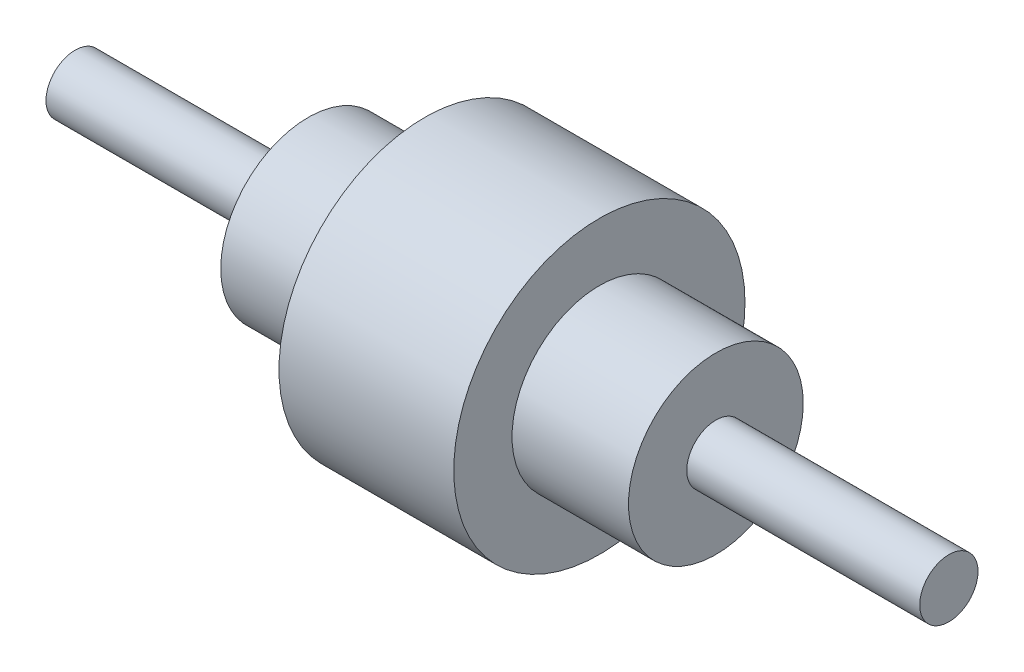
ISO-10303-21;
HEADER;
FILE_DESCRIPTION(('STEP AP214'),'2;1');
FILE_NAME('part.step','',(''),(''),'','','');
FILE_SCHEMA(('AUTOMOTIVE_DESIGN { 1 0 10303 214 1 1 1 1 }'));
ENDSEC;
DATA;
#1=APPLICATION_CONTEXT('core data for automotive mechanical design processes');
#2=APPLICATION_PROTOCOL_DEFINITION('international standard','automotive_design',2000,#1);
#3=PRODUCT_CONTEXT('',#1,'mechanical');
#4=PRODUCT('Part','Part','',(#3));
#5=PRODUCT_RELATED_PRODUCT_CATEGORY('part','',(#4));
#6=PRODUCT_DEFINITION_FORMATION('','',#4);
#7=PRODUCT_DEFINITION_CONTEXT('part definition',#1,'design');
#8=PRODUCT_DEFINITION('design','',#6,#7);
#9=PRODUCT_DEFINITION_SHAPE('','',#8);
#10=(LENGTH_UNIT() NAMED_UNIT(*) SI_UNIT(.MILLI.,.METRE.));
#11=(NAMED_UNIT(*) PLANE_ANGLE_UNIT() SI_UNIT($,.RADIAN.));
#12=(NAMED_UNIT(*) SI_UNIT($,.STERADIAN.) SOLID_ANGLE_UNIT());
#13=UNCERTAINTY_MEASURE_WITH_UNIT(LENGTH_MEASURE(1.E-05),#10,'distance_accuracy_value','');
#14=(GEOMETRIC_REPRESENTATION_CONTEXT(3) GLOBAL_UNCERTAINTY_ASSIGNED_CONTEXT((#13)) GLOBAL_UNIT_ASSIGNED_CONTEXT((#10,
#11,#12)) REPRESENTATION_CONTEXT('',''));
#15=CARTESIAN_POINT('',(0.,0.,0.));
#16=DIRECTION('',(0.,0.,1.));
#17=DIRECTION('',(1.,0.,0.));
#18=AXIS2_PLACEMENT_3D('',#15,#16,#17);
#19=CARTESIAN_POINT('',(30.,0.,0.));
#20=DIRECTION('',(-1.,0.,0.));
#21=DIRECTION('',(0.,0.,1.));
#22=AXIS2_PLACEMENT_3D('',#19,#20,#21);
#23=CYLINDRICAL_SURFACE('',#22,50.);
#24=CARTESIAN_POINT('',(30.,0.,0.));
#25=DIRECTION('',(1.,0.,0.));
#26=DIRECTION('',(0.,0.,-1.));
#27=AXIS2_PLACEMENT_3D('',#24,#25,#26);
#28=CIRCLE('',#27,50.);
#29=CARTESIAN_POINT('',(30.,0.,-50.));
#30=VERTEX_POINT('',#29);
#31=EDGE_CURVE('E54',#30,#30,#28,.T.);
#32=ORIENTED_EDGE('',*,*,#31,.F.);
#33=EDGE_LOOP('',(#32));
#34=FACE_BOUND('',#33,.T.);
#35=CARTESIAN_POINT('',(-30.,0.,0.));
#36=DIRECTION('',(1.,0.,0.));
#37=DIRECTION('',(0.,0.,-1.));
#38=AXIS2_PLACEMENT_3D('',#35,#36,#37);
#39=CIRCLE('',#38,50.);
#40=CARTESIAN_POINT('',(-30.,0.,-50.));
#41=VERTEX_POINT('',#40);
#42=EDGE_CURVE('E62',#41,#41,#39,.T.);
#43=ORIENTED_EDGE('',*,*,#42,.T.);
#44=EDGE_LOOP('',(#43));
#45=FACE_BOUND('',#44,.T.);
#46=ADVANCED_FACE('F43',(#34,#45),#23,.T.);
#47=CARTESIAN_POINT('',(30.,0.,0.));
#48=DIRECTION('',(1.,0.,0.));
#49=DIRECTION('',(0.,0.,-1.));
#50=AXIS2_PLACEMENT_3D('',#47,#48,#49);
#51=PLANE('',#50);
#52=CARTESIAN_POINT('',(30.,0.,0.));
#53=DIRECTION('',(1.,0.,0.));
#54=DIRECTION('',(0.,0.,-1.));
#55=AXIS2_PLACEMENT_3D('',#52,#53,#54);
#56=CIRCLE('',#55,30.);
#57=CARTESIAN_POINT('',(30.,0.,-30.));
#58=VERTEX_POINT('',#57);
#59=EDGE_CURVE('E59',#58,#58,#56,.T.);
#60=ORIENTED_EDGE('',*,*,#59,.F.);
#61=EDGE_LOOP('',(#60));
#62=FACE_BOUND('',#61,.T.);
#63=ORIENTED_EDGE('',*,*,#31,.T.);
#64=EDGE_LOOP('',(#63));
#65=FACE_BOUND('',#64,.T.);
#66=ADVANCED_FACE('F97',(#62,#65),#51,.T.);
#67=CARTESIAN_POINT('',(60.,0.,0.));
#68=DIRECTION('',(-1.,0.,0.));
#69=DIRECTION('',(0.,0.,1.));
#70=AXIS2_PLACEMENT_3D('',#67,#68,#69);
#71=CYLINDRICAL_SURFACE('',#70,30.);
#72=ORIENTED_EDGE('',*,*,#59,.T.);
#73=EDGE_LOOP('',(#72));
#74=FACE_BOUND('',#73,.T.);
#75=CARTESIAN_POINT('',(70.,0.,0.));
#76=DIRECTION('',(1.,0.,0.));
#77=DIRECTION('',(0.,0.,-1.));
#78=AXIS2_PLACEMENT_3D('',#75,#76,#77);
#79=CIRCLE('',#78,30.);
#80=CARTESIAN_POINT('',(70.,0.,-30.));
#81=VERTEX_POINT('',#80);
#82=EDGE_CURVE('E71',#81,#81,#79,.T.);
#83=ORIENTED_EDGE('',*,*,#82,.F.);
#84=EDGE_LOOP('',(#83));
#85=FACE_BOUND('',#84,.T.);
#86=ADVANCED_FACE('F102',(#74,#85),#71,.T.);
#87=CARTESIAN_POINT('',(-30.,0.,0.));
#88=DIRECTION('',(-1.,0.,0.));
#89=DIRECTION('',(0.,0.,-1.));
#90=AXIS2_PLACEMENT_3D('',#87,#88,#89);
#91=PLANE('',#90);
#92=CARTESIAN_POINT('',(-30.,0.,0.));
#93=DIRECTION('',(-1.,0.,0.));
#94=DIRECTION('',(0.,0.,1.));
#95=AXIS2_PLACEMENT_3D('',#92,#93,#94);
#96=CIRCLE('',#95,30.);
#97=CARTESIAN_POINT('',(-30.,0.,30.));
#98=VERTEX_POINT('',#97);
#99=EDGE_CURVE('E50',#98,#98,#96,.T.);
#100=ORIENTED_EDGE('',*,*,#99,.F.);
#101=EDGE_LOOP('',(#100));
#102=FACE_BOUND('',#101,.T.);
#103=ORIENTED_EDGE('',*,*,#42,.F.);
#104=EDGE_LOOP('',(#103));
#105=FACE_BOUND('',#104,.T.);
#106=ADVANCED_FACE('F108',(#102,#105),#91,.T.);
#107=CARTESIAN_POINT('',(-60.,0.,0.));
#108=DIRECTION('',(1.,0.,0.));
#109=DIRECTION('',(0.,0.,-1.));
#110=AXIS2_PLACEMENT_3D('',#107,#108,#109);
#111=CYLINDRICAL_SURFACE('',#110,30.);
#112=ORIENTED_EDGE('',*,*,#99,.T.);
#113=EDGE_LOOP('',(#112));
#114=FACE_BOUND('',#113,.T.);
#115=CARTESIAN_POINT('',(-70.,0.,0.));
#116=DIRECTION('',(-1.,0.,0.));
#117=DIRECTION('',(0.,0.,1.));
#118=AXIS2_PLACEMENT_3D('',#115,#116,#117);
#119=CIRCLE('',#118,30.);
#120=CARTESIAN_POINT('',(-70.,0.,30.));
#121=VERTEX_POINT('',#120);
#122=EDGE_CURVE('E65',#121,#121,#119,.T.);
#123=ORIENTED_EDGE('',*,*,#122,.F.);
#124=EDGE_LOOP('',(#123));
#125=FACE_BOUND('',#124,.T.);
#126=ADVANCED_FACE('F110',(#114,#125),#111,.T.);
#127=CARTESIAN_POINT('',(-70.,0.,0.));
#128=DIRECTION('',(-1.,0.,0.));
#129=DIRECTION('',(0.,0.,1.));
#130=AXIS2_PLACEMENT_3D('',#127,#128,#129);
#131=PLANE('',#130);
#132=CARTESIAN_POINT('',(-70.,0.,0.));
#133=DIRECTION('',(-1.,0.,0.));
#134=DIRECTION('',(0.,0.,1.));
#135=AXIS2_PLACEMENT_3D('',#132,#133,#134);
#136=CIRCLE('',#135,10.);
#137=CARTESIAN_POINT('',(-70.,0.,10.));
#138=VERTEX_POINT('',#137);
#139=EDGE_CURVE('E12',#138,#138,#136,.F.);
#140=ORIENTED_EDGE('',*,*,#139,.T.);
#141=EDGE_LOOP('',(#140));
#142=FACE_BOUND('',#141,.T.);
#143=ORIENTED_EDGE('',*,*,#122,.T.);
#144=EDGE_LOOP('',(#143));
#145=FACE_BOUND('',#144,.T.);
#146=ADVANCED_FACE('F116',(#142,#145),#131,.T.);
#147=CARTESIAN_POINT('',(-140.,0.,0.));
#148=DIRECTION('',(1.,0.,0.));
#149=DIRECTION('',(0.,0.,-1.));
#150=AXIS2_PLACEMENT_3D('',#147,#148,#149);
#151=CYLINDRICAL_SURFACE('',#150,10.);
#152=ORIENTED_EDGE('',*,*,#139,.F.);
#153=EDGE_LOOP('',(#152));
#154=FACE_BOUND('',#153,.T.);
#155=CARTESIAN_POINT('',(-150.,0.,0.));
#156=DIRECTION('',(-1.,0.,0.));
#157=DIRECTION('',(0.,0.,1.));
#158=AXIS2_PLACEMENT_3D('',#155,#156,#157);
#159=CIRCLE('',#158,10.);
#160=CARTESIAN_POINT('',(-150.,0.,10.));
#161=VERTEX_POINT('',#160);
#162=EDGE_CURVE('E68',#161,#161,#159,.T.);
#163=ORIENTED_EDGE('',*,*,#162,.F.);
#164=EDGE_LOOP('',(#163));
#165=FACE_BOUND('',#164,.T.);
#166=ADVANCED_FACE('F122',(#154,#165),#151,.T.);
#167=CARTESIAN_POINT('',(-150.,0.,0.));
#168=DIRECTION('',(-1.,0.,0.));
#169=DIRECTION('',(0.,0.,1.));
#170=AXIS2_PLACEMENT_3D('',#167,#168,#169);
#171=PLANE('',#170);
#172=ORIENTED_EDGE('',*,*,#162,.T.);
#173=EDGE_LOOP('',(#172));
#174=FACE_BOUND('',#173,.T.);
#175=ADVANCED_FACE('F90',(#174),#171,.T.);
#176=CARTESIAN_POINT('',(70.,0.,0.));
#177=DIRECTION('',(1.,0.,0.));
#178=DIRECTION('',(0.,0.,-1.));
#179=AXIS2_PLACEMENT_3D('',#176,#177,#178);
#180=PLANE('',#179);
#181=CARTESIAN_POINT('',(70.,0.,0.));
#182=DIRECTION('',(1.,0.,0.));
#183=DIRECTION('',(0.,0.,-1.));
#184=AXIS2_PLACEMENT_3D('',#181,#182,#183);
#185=CIRCLE('',#184,10.);
#186=CARTESIAN_POINT('',(70.,0.,-10.));
#187=VERTEX_POINT('',#186);
#188=EDGE_CURVE('E46',#187,#187,#185,.T.);
#189=ORIENTED_EDGE('',*,*,#188,.F.);
#190=EDGE_LOOP('',(#189));
#191=FACE_BOUND('',#190,.T.);
#192=ORIENTED_EDGE('',*,*,#82,.T.);
#193=EDGE_LOOP('',(#192));
#194=FACE_BOUND('',#193,.T.);
#195=ADVANCED_FACE('F82',(#191,#194),#180,.T.);
#196=CARTESIAN_POINT('',(140.,0.,0.));
#197=DIRECTION('',(-1.,0.,0.));
#198=DIRECTION('',(0.,0.,1.));
#199=AXIS2_PLACEMENT_3D('',#196,#197,#198);
#200=CYLINDRICAL_SURFACE('',#199,10.);
#201=ORIENTED_EDGE('',*,*,#188,.T.);
#202=EDGE_LOOP('',(#201));
#203=FACE_BOUND('',#202,.T.);
#204=CARTESIAN_POINT('',(150.,0.,0.));
#205=DIRECTION('',(1.,0.,0.));
#206=DIRECTION('',(0.,0.,-1.));
#207=AXIS2_PLACEMENT_3D('',#204,#205,#206);
#208=CIRCLE('',#207,10.);
#209=CARTESIAN_POINT('',(150.,0.,-10.));
#210=VERTEX_POINT('',#209);
#211=EDGE_CURVE('E74',#210,#210,#208,.T.);
#212=ORIENTED_EDGE('',*,*,#211,.F.);
#213=EDGE_LOOP('',(#212));
#214=FACE_BOUND('',#213,.T.);
#215=ADVANCED_FACE('F80',(#203,#214),#200,.T.);
#216=CARTESIAN_POINT('',(150.,0.,0.));
#217=DIRECTION('',(1.,0.,0.));
#218=DIRECTION('',(0.,0.,-1.));
#219=AXIS2_PLACEMENT_3D('',#216,#217,#218);
#220=PLANE('',#219);
#221=ORIENTED_EDGE('',*,*,#211,.T.);
#222=EDGE_LOOP('',(#221));
#223=FACE_BOUND('',#222,.T.);
#224=ADVANCED_FACE('F78',(#223),#220,.T.);
#225=CLOSED_SHELL('',(#46,#66,#86,#106,#126,#146,#166,#175,#195,#215,#224));
#226=MANIFOLD_SOLID_BREP('B2',#225);
#227=ADVANCED_BREP_SHAPE_REPRESENTATION('',(#18,#226),#14);
#228=SHAPE_DEFINITION_REPRESENTATION(#9,#227);
ENDSEC;
END-ISO-10303-21;
